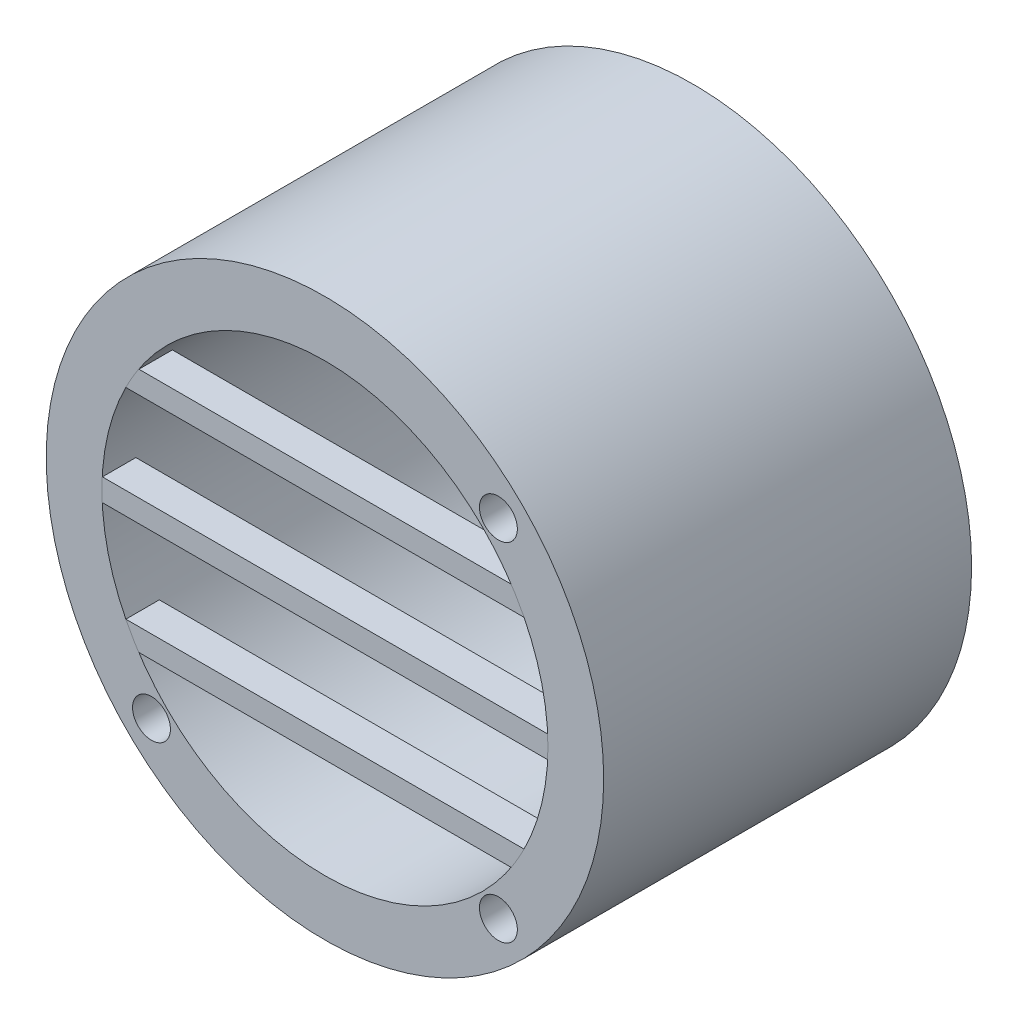
ISO-10303-21;
HEADER;
FILE_DESCRIPTION(('STEP AP214'),'2;1');
FILE_NAME('part.step','',(''),(''),'','','');
FILE_SCHEMA(('AUTOMOTIVE_DESIGN { 1 0 10303 214 1 1 1 1 }'));
ENDSEC;
DATA;
#1=APPLICATION_CONTEXT('core data for automotive mechanical design processes');
#2=APPLICATION_PROTOCOL_DEFINITION('international standard','automotive_design',2000,#1);
#3=PRODUCT_CONTEXT('',#1,'mechanical');
#4=PRODUCT('Part','Part','',(#3));
#5=PRODUCT_RELATED_PRODUCT_CATEGORY('part','',(#4));
#6=PRODUCT_DEFINITION_FORMATION('','',#4);
#7=PRODUCT_DEFINITION_CONTEXT('part definition',#1,'design');
#8=PRODUCT_DEFINITION('design','',#6,#7);
#9=PRODUCT_DEFINITION_SHAPE('','',#8);
#10=(LENGTH_UNIT() NAMED_UNIT(*) SI_UNIT(.MILLI.,.METRE.));
#11=(NAMED_UNIT(*) PLANE_ANGLE_UNIT() SI_UNIT($,.RADIAN.));
#12=(NAMED_UNIT(*) SI_UNIT($,.STERADIAN.) SOLID_ANGLE_UNIT());
#13=UNCERTAINTY_MEASURE_WITH_UNIT(LENGTH_MEASURE(1.E-05),#10,'distance_accuracy_value','');
#14=(GEOMETRIC_REPRESENTATION_CONTEXT(3) GLOBAL_UNCERTAINTY_ASSIGNED_CONTEXT((#13)) GLOBAL_UNIT_ASSIGNED_CONTEXT((#10,
#11,#12)) REPRESENTATION_CONTEXT('',''));
#15=CARTESIAN_POINT('',(0.,0.,0.));
#16=DIRECTION('',(0.,0.,1.));
#17=DIRECTION('',(1.,0.,0.));
#18=AXIS2_PLACEMENT_3D('',#15,#16,#17);
#19=CARTESIAN_POINT('',(0.,-8.99999999999859,30.));
#20=DIRECTION('',(0.,-1.,0.));
#21=DIRECTION('',(0.,0.,-1.));
#22=AXIS2_PLACEMENT_3D('',#19,#20,#21);
#23=PLANE('',#22);
#24=DIRECTION('',(1.,0.,0.));
#25=VECTOR('',#24,1.);
#26=CARTESIAN_POINT('',(0.,-8.99999999999859,33.));
#27=LINE('',#26,#25);
#28=CARTESIAN_POINT('',(-17.8605710994925,-8.99999999999859,33.));
#29=VERTEX_POINT('',#28);
#30=CARTESIAN_POINT('',(17.8605710994925,-8.99999999999859,33.));
#31=VERTEX_POINT('',#30);
#32=EDGE_CURVE('E114',#29,#31,#27,.T.);
#33=ORIENTED_EDGE('',*,*,#32,.T.);
#34=DIRECTION('',(0.,0.,1.));
#35=VECTOR('',#34,1.);
#36=CARTESIAN_POINT('',(17.8605710994925,-8.99999999999859,30.));
#37=LINE('',#36,#35);
#38=CARTESIAN_POINT('',(17.8605710994925,-8.99999999999859,30.));
#39=VERTEX_POINT('',#38);
#40=EDGE_CURVE('E12',#39,#31,#37,.T.);
#41=ORIENTED_EDGE('',*,*,#40,.F.);
#42=DIRECTION('',(1.,0.,0.));
#43=VECTOR('',#42,1.);
#44=CARTESIAN_POINT('',(0.,-8.99999999999859,30.));
#45=LINE('',#44,#43);
#46=CARTESIAN_POINT('',(-17.8605710994925,-8.99999999999859,30.));
#47=VERTEX_POINT('',#46);
#48=EDGE_CURVE('E108',#47,#39,#45,.T.);
#49=ORIENTED_EDGE('',*,*,#48,.F.);
#50=DIRECTION('',(0.,0.,1.));
#51=VECTOR('',#50,1.);
#52=CARTESIAN_POINT('',(-17.8605710994925,-8.99999999999859,30.));
#53=LINE('',#52,#51);
#54=EDGE_CURVE('E54',#47,#29,#53,.T.);
#55=ORIENTED_EDGE('',*,*,#54,.T.);
#56=EDGE_LOOP('',(#33,#41,#49,#55));
#57=FACE_BOUND('',#56,.T.);
#58=ADVANCED_FACE('F51',(#57),#23,.F.);
#59=CARTESIAN_POINT('',(0.,0.,30.));
#60=DIRECTION('',(0.,0.,1.));
#61=DIRECTION('',(1.,0.,0.));
#62=AXIS2_PLACEMENT_3D('',#59,#60,#61);
#63=CYLINDRICAL_SURFACE('',#62,20.);
#64=CARTESIAN_POINT('',(0.,0.,33.));
#65=DIRECTION('',(0.,0.,1.));
#66=DIRECTION('',(1.,0.,0.));
#67=AXIS2_PLACEMENT_3D('',#64,#65,#66);
#68=CIRCLE('',#67,20.);
#69=CARTESIAN_POINT('',(16.703293088491,-10.9999999999986,33.));
#70=VERTEX_POINT('',#69);
#71=EDGE_CURVE('E90',#31,#70,#68,.F.);
#72=ORIENTED_EDGE('',*,*,#71,.T.);
#73=DIRECTION('',(0.,0.,1.));
#74=VECTOR('',#73,1.);
#75=CARTESIAN_POINT('',(16.703293088491,-10.9999999999986,30.));
#76=LINE('',#75,#74);
#77=CARTESIAN_POINT('',(16.703293088491,-10.9999999999986,30.));
#78=VERTEX_POINT('',#77);
#79=EDGE_CURVE('E60',#78,#70,#76,.T.);
#80=ORIENTED_EDGE('',*,*,#79,.F.);
#81=CARTESIAN_POINT('',(0.,0.,30.));
#82=DIRECTION('',(0.,0.,1.));
#83=DIRECTION('',(1.,0.,0.));
#84=AXIS2_PLACEMENT_3D('',#81,#82,#83);
#85=CIRCLE('',#84,20.);
#86=EDGE_CURVE('E68',#39,#78,#85,.F.);
#87=ORIENTED_EDGE('',*,*,#86,.F.);
#88=ORIENTED_EDGE('',*,*,#40,.T.);
#89=EDGE_LOOP('',(#72,#80,#87,#88));
#90=FACE_BOUND('',#89,.T.);
#91=ADVANCED_FACE('F122',(#90),#63,.T.);
#92=CARTESIAN_POINT('',(0.,-10.9999999999986,30.));
#93=DIRECTION('',(0.,-1.,0.));
#94=DIRECTION('',(0.,0.,-1.));
#95=AXIS2_PLACEMENT_3D('',#92,#93,#94);
#96=PLANE('',#95);
#97=DIRECTION('',(1.,0.,0.));
#98=VECTOR('',#97,1.);
#99=CARTESIAN_POINT('',(0.,-10.9999999999986,33.));
#100=LINE('',#99,#98);
#101=CARTESIAN_POINT('',(-16.703293088491,-10.9999999999986,33.));
#102=VERTEX_POINT('',#101);
#103=EDGE_CURVE('E102',#102,#70,#100,.T.);
#104=ORIENTED_EDGE('',*,*,#103,.F.);
#105=DIRECTION('',(0.,0.,1.));
#106=VECTOR('',#105,1.);
#107=CARTESIAN_POINT('',(-16.703293088491,-10.9999999999986,30.));
#108=LINE('',#107,#106);
#109=CARTESIAN_POINT('',(-16.703293088491,-10.9999999999986,30.));
#110=VERTEX_POINT('',#109);
#111=EDGE_CURVE('E99',#110,#102,#108,.T.);
#112=ORIENTED_EDGE('',*,*,#111,.F.);
#113=DIRECTION('',(1.,0.,0.));
#114=VECTOR('',#113,1.);
#115=CARTESIAN_POINT('',(0.,-10.9999999999986,30.));
#116=LINE('',#115,#114);
#117=EDGE_CURVE('E101',#110,#78,#116,.T.);
#118=ORIENTED_EDGE('',*,*,#117,.T.);
#119=ORIENTED_EDGE('',*,*,#79,.T.);
#120=EDGE_LOOP('',(#104,#112,#118,#119));
#121=FACE_BOUND('',#120,.T.);
#122=ADVANCED_FACE('F100',(#121),#96,.T.);
#123=EDGE_CURVE('E117',#102,#29,#68,.F.);
#124=ORIENTED_EDGE('',*,*,#123,.T.);
#125=ORIENTED_EDGE('',*,*,#54,.F.);
#126=EDGE_CURVE('E96',#110,#47,#85,.F.);
#127=ORIENTED_EDGE('',*,*,#126,.F.);
#128=ORIENTED_EDGE('',*,*,#111,.T.);
#129=EDGE_LOOP('',(#124,#125,#127,#128));
#130=FACE_BOUND('',#129,.T.);
#131=ADVANCED_FACE('F105',(#130),#63,.T.);
#132=CARTESIAN_POINT('',(0.,0.,30.));
#133=DIRECTION('',(0.,0.,1.));
#134=DIRECTION('',(1.,0.,0.));
#135=AXIS2_PLACEMENT_3D('',#132,#133,#134);
#136=PLANE('',#135);
#137=ORIENTED_EDGE('',*,*,#48,.T.);
#138=ORIENTED_EDGE('',*,*,#86,.T.);
#139=ORIENTED_EDGE('',*,*,#117,.F.);
#140=ORIENTED_EDGE('',*,*,#126,.T.);
#141=EDGE_LOOP('',(#137,#138,#139,#140));
#142=FACE_BOUND('',#141,.T.);
#143=ADVANCED_FACE('F110',(#142),#136,.F.);
#144=CARTESIAN_POINT('',(0.,0.,33.));
#145=DIRECTION('',(0.,0.,1.));
#146=DIRECTION('',(1.,0.,0.));
#147=AXIS2_PLACEMENT_3D('',#144,#145,#146);
#148=PLANE('',#147);
#149=ORIENTED_EDGE('',*,*,#32,.F.);
#150=ORIENTED_EDGE('',*,*,#123,.F.);
#151=ORIENTED_EDGE('',*,*,#103,.T.);
#152=ORIENTED_EDGE('',*,*,#71,.F.);
#153=EDGE_LOOP('',(#149,#150,#151,#152));
#154=FACE_BOUND('',#153,.T.);
#155=ADVANCED_FACE('F134',(#154),#148,.T.);
#156=CLOSED_SHELL('',(#58,#91,#122,#131,#143,#155));
#157=MANIFOLD_SOLID_BREP('B2',#156);
#158=CARTESIAN_POINT('',(0.,1.00000000000141,30.));
#159=DIRECTION('',(0.,-1.,0.));
#160=DIRECTION('',(0.,0.,-1.));
#161=AXIS2_PLACEMENT_3D('',#158,#159,#160);
#162=PLANE('',#161);
#163=DIRECTION('',(1.,0.,0.));
#164=VECTOR('',#163,1.);
#165=CARTESIAN_POINT('',(0.,1.00000000000141,33.));
#166=LINE('',#165,#164);
#167=CARTESIAN_POINT('',(-19.9749843554381,1.00000000000141,33.));
#168=VERTEX_POINT('',#167);
#169=CARTESIAN_POINT('',(19.9749843554381,1.00000000000141,33.));
#170=VERTEX_POINT('',#169);
#171=EDGE_CURVE('E256',#168,#170,#166,.T.);
#172=ORIENTED_EDGE('',*,*,#171,.T.);
#173=DIRECTION('',(0.,0.,1.));
#174=VECTOR('',#173,1.);
#175=CARTESIAN_POINT('',(19.9749843554381,1.00000000000141,30.));
#176=LINE('',#175,#174);
#177=CARTESIAN_POINT('',(19.9749843554381,1.00000000000141,30.));
#178=VERTEX_POINT('',#177);
#179=EDGE_CURVE('E49',#178,#170,#176,.T.);
#180=ORIENTED_EDGE('',*,*,#179,.F.);
#181=DIRECTION('',(1.,0.,0.));
#182=VECTOR('',#181,1.);
#183=CARTESIAN_POINT('',(0.,1.00000000000141,30.));
#184=LINE('',#183,#182);
#185=CARTESIAN_POINT('',(-19.9749843554381,1.00000000000141,30.));
#186=VERTEX_POINT('',#185);
#187=EDGE_CURVE('E250',#186,#178,#184,.T.);
#188=ORIENTED_EDGE('',*,*,#187,.F.);
#189=DIRECTION('',(0.,0.,1.));
#190=VECTOR('',#189,1.);
#191=CARTESIAN_POINT('',(-19.9749843554381,1.00000000000141,30.));
#192=LINE('',#191,#190);
#193=EDGE_CURVE('E196',#186,#168,#192,.T.);
#194=ORIENTED_EDGE('',*,*,#193,.T.);
#195=EDGE_LOOP('',(#172,#180,#188,#194));
#196=FACE_BOUND('',#195,.T.);
#197=ADVANCED_FACE('F193',(#196),#162,.F.);
#198=CARTESIAN_POINT('',(0.,0.,30.));
#199=DIRECTION('',(0.,0.,1.));
#200=DIRECTION('',(1.,0.,0.));
#201=AXIS2_PLACEMENT_3D('',#198,#199,#200);
#202=CYLINDRICAL_SURFACE('',#201,20.);
#203=CARTESIAN_POINT('',(0.,0.,33.));
#204=DIRECTION('',(0.,0.,1.));
#205=DIRECTION('',(1.,0.,0.));
#206=AXIS2_PLACEMENT_3D('',#203,#204,#205);
#207=CIRCLE('',#206,20.);
#208=CARTESIAN_POINT('',(19.9749843554382,-0.999999999998591,33.));
#209=VERTEX_POINT('',#208);
#210=EDGE_CURVE('E232',#170,#209,#207,.F.);
#211=ORIENTED_EDGE('',*,*,#210,.T.);
#212=DIRECTION('',(0.,0.,1.));
#213=VECTOR('',#212,1.);
#214=CARTESIAN_POINT('',(19.9749843554382,-0.999999999998591,30.));
#215=LINE('',#214,#213);
#216=CARTESIAN_POINT('',(19.9749843554382,-0.999999999998591,30.));
#217=VERTEX_POINT('',#216);
#218=EDGE_CURVE('E202',#217,#209,#215,.T.);
#219=ORIENTED_EDGE('',*,*,#218,.F.);
#220=CARTESIAN_POINT('',(0.,0.,30.));
#221=DIRECTION('',(0.,0.,1.));
#222=DIRECTION('',(1.,0.,0.));
#223=AXIS2_PLACEMENT_3D('',#220,#221,#222);
#224=CIRCLE('',#223,20.);
#225=EDGE_CURVE('E210',#178,#217,#224,.F.);
#226=ORIENTED_EDGE('',*,*,#225,.F.);
#227=ORIENTED_EDGE('',*,*,#179,.T.);
#228=EDGE_LOOP('',(#211,#219,#226,#227));
#229=FACE_BOUND('',#228,.T.);
#230=ADVANCED_FACE('F264',(#229),#202,.T.);
#231=CARTESIAN_POINT('',(0.,-0.999999999998591,30.));
#232=DIRECTION('',(0.,-1.,0.));
#233=DIRECTION('',(0.,0.,-1.));
#234=AXIS2_PLACEMENT_3D('',#231,#232,#233);
#235=PLANE('',#234);
#236=DIRECTION('',(1.,0.,0.));
#237=VECTOR('',#236,1.);
#238=CARTESIAN_POINT('',(0.,-0.999999999998591,33.));
#239=LINE('',#238,#237);
#240=CARTESIAN_POINT('',(-19.9749843554382,-0.999999999998591,33.));
#241=VERTEX_POINT('',#240);
#242=EDGE_CURVE('E244',#241,#209,#239,.T.);
#243=ORIENTED_EDGE('',*,*,#242,.F.);
#244=DIRECTION('',(0.,0.,1.));
#245=VECTOR('',#244,1.);
#246=CARTESIAN_POINT('',(-19.9749843554382,-0.999999999998591,30.));
#247=LINE('',#246,#245);
#248=CARTESIAN_POINT('',(-19.9749843554382,-0.999999999998591,30.));
#249=VERTEX_POINT('',#248);
#250=EDGE_CURVE('E241',#249,#241,#247,.T.);
#251=ORIENTED_EDGE('',*,*,#250,.F.);
#252=DIRECTION('',(1.,0.,0.));
#253=VECTOR('',#252,1.);
#254=CARTESIAN_POINT('',(0.,-0.999999999998591,30.));
#255=LINE('',#254,#253);
#256=EDGE_CURVE('E243',#249,#217,#255,.T.);
#257=ORIENTED_EDGE('',*,*,#256,.T.);
#258=ORIENTED_EDGE('',*,*,#218,.T.);
#259=EDGE_LOOP('',(#243,#251,#257,#258));
#260=FACE_BOUND('',#259,.T.);
#261=ADVANCED_FACE('F242',(#260),#235,.T.);
#262=EDGE_CURVE('E259',#241,#168,#207,.F.);
#263=ORIENTED_EDGE('',*,*,#262,.T.);
#264=ORIENTED_EDGE('',*,*,#193,.F.);
#265=EDGE_CURVE('E238',#249,#186,#224,.F.);
#266=ORIENTED_EDGE('',*,*,#265,.F.);
#267=ORIENTED_EDGE('',*,*,#250,.T.);
#268=EDGE_LOOP('',(#263,#264,#266,#267));
#269=FACE_BOUND('',#268,.T.);
#270=ADVANCED_FACE('F247',(#269),#202,.T.);
#271=CARTESIAN_POINT('',(0.,0.,30.));
#272=DIRECTION('',(0.,0.,1.));
#273=DIRECTION('',(1.,0.,0.));
#274=AXIS2_PLACEMENT_3D('',#271,#272,#273);
#275=PLANE('',#274);
#276=ORIENTED_EDGE('',*,*,#187,.T.);
#277=ORIENTED_EDGE('',*,*,#225,.T.);
#278=ORIENTED_EDGE('',*,*,#256,.F.);
#279=ORIENTED_EDGE('',*,*,#265,.T.);
#280=EDGE_LOOP('',(#276,#277,#278,#279));
#281=FACE_BOUND('',#280,.T.);
#282=ADVANCED_FACE('F252',(#281),#275,.F.);
#283=CARTESIAN_POINT('',(0.,0.,33.));
#284=DIRECTION('',(0.,0.,1.));
#285=DIRECTION('',(1.,0.,0.));
#286=AXIS2_PLACEMENT_3D('',#283,#284,#285);
#287=PLANE('',#286);
#288=ORIENTED_EDGE('',*,*,#171,.F.);
#289=ORIENTED_EDGE('',*,*,#262,.F.);
#290=ORIENTED_EDGE('',*,*,#242,.T.);
#291=ORIENTED_EDGE('',*,*,#210,.F.);
#292=EDGE_LOOP('',(#288,#289,#290,#291));
#293=FACE_BOUND('',#292,.T.);
#294=ADVANCED_FACE('F276',(#293),#287,.T.);
#295=CLOSED_SHELL('',(#197,#230,#261,#270,#282,#294));
#296=MANIFOLD_SOLID_BREP('B6',#295);
#297=CARTESIAN_POINT('',(0.,0.,30.));
#298=DIRECTION('',(0.,0.,1.));
#299=DIRECTION('',(1.,0.,0.));
#300=AXIS2_PLACEMENT_3D('',#297,#298,#299);
#301=CYLINDRICAL_SURFACE('',#300,20.);
#302=CARTESIAN_POINT('',(0.,0.,33.));
#303=DIRECTION('',(0.,0.,1.));
#304=DIRECTION('',(1.,0.,0.));
#305=AXIS2_PLACEMENT_3D('',#302,#303,#304);
#306=CIRCLE('',#305,20.);
#307=CARTESIAN_POINT('',(-17.860571099491,9.00000000000141,33.));
#308=VERTEX_POINT('',#307);
#309=CARTESIAN_POINT('',(-16.7032930884891,11.0000000000014,33.));
#310=VERTEX_POINT('',#309);
#311=EDGE_CURVE('E389',#308,#310,#306,.F.);
#312=ORIENTED_EDGE('',*,*,#311,.T.);
#313=DIRECTION('',(0.,0.,1.));
#314=VECTOR('',#313,1.);
#315=CARTESIAN_POINT('',(-16.7032930884891,11.0000000000014,30.));
#316=LINE('',#315,#314);
#317=CARTESIAN_POINT('',(-16.7032930884891,11.0000000000014,30.));
#318=VERTEX_POINT('',#317);
#319=EDGE_CURVE('E191',#318,#310,#316,.T.);
#320=ORIENTED_EDGE('',*,*,#319,.F.);
#321=CARTESIAN_POINT('',(0.,0.,30.));
#322=DIRECTION('',(0.,0.,1.));
#323=DIRECTION('',(1.,0.,0.));
#324=AXIS2_PLACEMENT_3D('',#321,#322,#323);
#325=CIRCLE('',#324,20.);
#326=CARTESIAN_POINT('',(-17.860571099491,9.00000000000141,30.));
#327=VERTEX_POINT('',#326);
#328=EDGE_CURVE('E380',#327,#318,#325,.F.);
#329=ORIENTED_EDGE('',*,*,#328,.F.);
#330=DIRECTION('',(0.,0.,1.));
#331=VECTOR('',#330,1.);
#332=CARTESIAN_POINT('',(-17.860571099491,9.00000000000141,30.));
#333=LINE('',#332,#331);
#334=EDGE_CURVE('E330',#327,#308,#333,.T.);
#335=ORIENTED_EDGE('',*,*,#334,.T.);
#336=EDGE_LOOP('',(#312,#320,#329,#335));
#337=FACE_BOUND('',#336,.T.);
#338=ADVANCED_FACE('F326',(#337),#301,.T.);
#339=CARTESIAN_POINT('',(0.,11.0000000000014,30.));
#340=DIRECTION('',(0.,-1.,0.));
#341=DIRECTION('',(0.,0.,-1.));
#342=AXIS2_PLACEMENT_3D('',#339,#340,#341);
#343=PLANE('',#342);
#344=DIRECTION('',(1.,0.,0.));
#345=VECTOR('',#344,1.);
#346=CARTESIAN_POINT('',(0.,11.0000000000014,33.));
#347=LINE('',#346,#345);
#348=CARTESIAN_POINT('',(16.7032930884891,11.0000000000014,33.));
#349=VERTEX_POINT('',#348);
#350=EDGE_CURVE('E358',#310,#349,#347,.T.);
#351=ORIENTED_EDGE('',*,*,#350,.T.);
#352=DIRECTION('',(0.,0.,1.));
#353=VECTOR('',#352,1.);
#354=CARTESIAN_POINT('',(16.7032930884891,11.0000000000014,30.));
#355=LINE('',#354,#353);
#356=CARTESIAN_POINT('',(16.7032930884891,11.0000000000014,30.));
#357=VERTEX_POINT('',#356);
#358=EDGE_CURVE('E336',#357,#349,#355,.T.);
#359=ORIENTED_EDGE('',*,*,#358,.F.);
#360=DIRECTION('',(1.,0.,0.));
#361=VECTOR('',#360,1.);
#362=CARTESIAN_POINT('',(0.,11.0000000000014,30.));
#363=LINE('',#362,#361);
#364=EDGE_CURVE('E344',#318,#357,#363,.T.);
#365=ORIENTED_EDGE('',*,*,#364,.F.);
#366=ORIENTED_EDGE('',*,*,#319,.T.);
#367=EDGE_LOOP('',(#351,#359,#365,#366));
#368=FACE_BOUND('',#367,.T.);
#369=ADVANCED_FACE('F398',(#368),#343,.F.);
#370=CARTESIAN_POINT('',(17.860571099491,9.00000000000141,33.));
#371=VERTEX_POINT('',#370);
#372=EDGE_CURVE('E384',#349,#371,#306,.F.);
#373=ORIENTED_EDGE('',*,*,#372,.T.);
#374=DIRECTION('',(0.,0.,1.));
#375=VECTOR('',#374,1.);
#376=CARTESIAN_POINT('',(17.860571099491,9.00000000000141,30.));
#377=LINE('',#376,#375);
#378=CARTESIAN_POINT('',(17.860571099491,9.00000000000141,30.));
#379=VERTEX_POINT('',#378);
#380=EDGE_CURVE('E382',#379,#371,#377,.T.);
#381=ORIENTED_EDGE('',*,*,#380,.F.);
#382=EDGE_CURVE('E374',#357,#379,#325,.F.);
#383=ORIENTED_EDGE('',*,*,#382,.F.);
#384=ORIENTED_EDGE('',*,*,#358,.T.);
#385=EDGE_LOOP('',(#373,#381,#383,#384));
#386=FACE_BOUND('',#385,.T.);
#387=ADVANCED_FACE('F383',(#386),#301,.T.);
#388=CARTESIAN_POINT('',(0.,9.00000000000141,30.));
#389=DIRECTION('',(0.,-1.,0.));
#390=DIRECTION('',(1.,0.,0.));
#391=AXIS2_PLACEMENT_3D('',#388,#389,#390);
#392=PLANE('',#391);
#393=DIRECTION('',(1.,0.,0.));
#394=VECTOR('',#393,1.);
#395=CARTESIAN_POINT('',(0.,9.00000000000141,33.));
#396=LINE('',#395,#394);
#397=EDGE_CURVE('E392',#308,#371,#396,.T.);
#398=ORIENTED_EDGE('',*,*,#397,.F.);
#399=ORIENTED_EDGE('',*,*,#334,.F.);
#400=DIRECTION('',(1.,0.,0.));
#401=VECTOR('',#400,1.);
#402=CARTESIAN_POINT('',(0.,9.00000000000141,30.));
#403=LINE('',#402,#401);
#404=EDGE_CURVE('E377',#327,#379,#403,.T.);
#405=ORIENTED_EDGE('',*,*,#404,.T.);
#406=ORIENTED_EDGE('',*,*,#380,.T.);
#407=EDGE_LOOP('',(#398,#399,#405,#406));
#408=FACE_BOUND('',#407,.T.);
#409=ADVANCED_FACE('F328',(#408),#392,.T.);
#410=CARTESIAN_POINT('',(0.,0.,30.));
#411=DIRECTION('',(0.,0.,1.));
#412=DIRECTION('',(1.,0.,0.));
#413=AXIS2_PLACEMENT_3D('',#410,#411,#412);
#414=PLANE('',#413);
#415=ORIENTED_EDGE('',*,*,#328,.T.);
#416=ORIENTED_EDGE('',*,*,#364,.T.);
#417=ORIENTED_EDGE('',*,*,#382,.T.);
#418=ORIENTED_EDGE('',*,*,#404,.F.);
#419=EDGE_LOOP('',(#415,#416,#417,#418));
#420=FACE_BOUND('',#419,.T.);
#421=ADVANCED_FACE('F376',(#420),#414,.F.);
#422=CARTESIAN_POINT('',(0.,0.,33.));
#423=DIRECTION('',(0.,0.,1.));
#424=DIRECTION('',(1.,0.,0.));
#425=AXIS2_PLACEMENT_3D('',#422,#423,#424);
#426=PLANE('',#425);
#427=ORIENTED_EDGE('',*,*,#311,.F.);
#428=ORIENTED_EDGE('',*,*,#397,.T.);
#429=ORIENTED_EDGE('',*,*,#372,.F.);
#430=ORIENTED_EDGE('',*,*,#350,.F.);
#431=EDGE_LOOP('',(#427,#428,#429,#430));
#432=FACE_BOUND('',#431,.T.);
#433=ADVANCED_FACE('F395',(#432),#426,.T.);
#434=CLOSED_SHELL('',(#338,#369,#387,#409,#421,#433));
#435=MANIFOLD_SOLID_BREP('B43',#434);
#436=CARTESIAN_POINT('',(0.,0.,33.));
#437=DIRECTION('',(0.,0.,1.));
#438=DIRECTION('',(1.,0.,0.));
#439=AXIS2_PLACEMENT_3D('',#436,#437,#438);
#440=PLANE('',#439);
#441=CARTESIAN_POINT('',(15.5563491861041,15.556349186104,33.));
#442=DIRECTION('',(0.,0.,-1.));
#443=DIRECTION('',(-1.,0.,0.));
#444=AXIS2_PLACEMENT_3D('',#441,#442,#443);
#445=CIRCLE('',#444,1.69999999999999);
#446=CARTESIAN_POINT('',(13.8563491861041,15.556349186104,33.));
#447=VERTEX_POINT('',#446);
#448=EDGE_CURVE('E490',#447,#447,#445,.T.);
#449=ORIENTED_EDGE('',*,*,#448,.T.);
#450=EDGE_LOOP('',(#449));
#451=FACE_BOUND('',#450,.T.);
#452=CARTESIAN_POINT('',(15.556349186104,-15.5563491861041,33.));
#453=DIRECTION('',(0.,0.,-1.));
#454=DIRECTION('',(-1.,0.,0.));
#455=AXIS2_PLACEMENT_3D('',#452,#453,#454);
#456=CIRCLE('',#455,1.69999999999999);
#457=CARTESIAN_POINT('',(13.856349186104,-15.5563491861041,33.));
#458=VERTEX_POINT('',#457);
#459=EDGE_CURVE('E484',#458,#458,#456,.T.);
#460=ORIENTED_EDGE('',*,*,#459,.T.);
#461=EDGE_LOOP('',(#460));
#462=FACE_BOUND('',#461,.T.);
#463=CARTESIAN_POINT('',(-15.5563491861041,-15.556349186104,33.));
#464=DIRECTION('',(0.,0.,-1.));
#465=DIRECTION('',(-1.,0.,0.));
#466=AXIS2_PLACEMENT_3D('',#463,#464,#465);
#467=CIRCLE('',#466,1.69999999999999);
#468=CARTESIAN_POINT('',(-17.2563491861041,-15.556349186104,33.));
#469=VERTEX_POINT('',#468);
#470=EDGE_CURVE('E481',#469,#469,#467,.T.);
#471=ORIENTED_EDGE('',*,*,#470,.T.);
#472=EDGE_LOOP('',(#471));
#473=FACE_BOUND('',#472,.T.);
#474=CARTESIAN_POINT('',(0.,0.,33.));
#475=DIRECTION('',(0.,0.,1.));
#476=DIRECTION('',(1.,0.,0.));
#477=AXIS2_PLACEMENT_3D('',#474,#475,#476);
#478=CIRCLE('',#477,25.);
#479=CARTESIAN_POINT('',(25.,0.,33.));
#480=VERTEX_POINT('',#479);
#481=EDGE_CURVE('E325',#480,#480,#478,.T.);
#482=ORIENTED_EDGE('',*,*,#481,.T.);
#483=EDGE_LOOP('',(#482));
#484=FACE_BOUND('',#483,.T.);
#485=CARTESIAN_POINT('',(0.,0.,33.));
#486=DIRECTION('',(0.,0.,1.));
#487=DIRECTION('',(1.,0.,0.));
#488=AXIS2_PLACEMENT_3D('',#485,#486,#487);
#489=CIRCLE('',#488,20.);
#490=CARTESIAN_POINT('',(20.,0.,33.));
#491=VERTEX_POINT('',#490);
#492=EDGE_CURVE('E471',#491,#491,#489,.T.);
#493=ORIENTED_EDGE('',*,*,#492,.F.);
#494=EDGE_LOOP('',(#493));
#495=FACE_BOUND('',#494,.T.);
#496=ADVANCED_FACE('F458',(#451,#462,#473,#484,#495),#440,.T.);
#497=CARTESIAN_POINT('',(0.,0.,0.));
#498=DIRECTION('',(0.,0.,1.));
#499=DIRECTION('',(1.,0.,0.));
#500=AXIS2_PLACEMENT_3D('',#497,#498,#499);
#501=PLANE('',#500);
#502=CARTESIAN_POINT('',(15.5563491861041,15.556349186104,0.));
#503=DIRECTION('',(0.,0.,1.));
#504=DIRECTION('',(1.,0.,0.));
#505=AXIS2_PLACEMENT_3D('',#502,#503,#504);
#506=CIRCLE('',#505,1.69999999999999);
#507=CARTESIAN_POINT('',(17.2563491861041,15.556349186104,0.));
#508=VERTEX_POINT('',#507);
#509=EDGE_CURVE('E487',#508,#508,#506,.T.);
#510=ORIENTED_EDGE('',*,*,#509,.T.);
#511=EDGE_LOOP('',(#510));
#512=FACE_BOUND('',#511,.T.);
#513=CARTESIAN_POINT('',(15.556349186104,-15.5563491861041,0.));
#514=DIRECTION('',(0.,0.,1.));
#515=DIRECTION('',(1.,0.,0.));
#516=AXIS2_PLACEMENT_3D('',#513,#514,#515);
#517=CIRCLE('',#516,1.69999999999999);
#518=CARTESIAN_POINT('',(17.256349186104,-15.5563491861041,0.));
#519=VERTEX_POINT('',#518);
#520=EDGE_CURVE('E462',#519,#519,#517,.T.);
#521=ORIENTED_EDGE('',*,*,#520,.T.);
#522=EDGE_LOOP('',(#521));
#523=FACE_BOUND('',#522,.T.);
#524=CARTESIAN_POINT('',(-15.5563491861041,-15.556349186104,0.));
#525=DIRECTION('',(0.,0.,1.));
#526=DIRECTION('',(1.,0.,0.));
#527=AXIS2_PLACEMENT_3D('',#524,#525,#526);
#528=CIRCLE('',#527,1.69999999999999);
#529=CARTESIAN_POINT('',(-13.8563491861041,-15.556349186104,0.));
#530=VERTEX_POINT('',#529);
#531=EDGE_CURVE('E476',#530,#530,#528,.T.);
#532=ORIENTED_EDGE('',*,*,#531,.T.);
#533=EDGE_LOOP('',(#532));
#534=FACE_BOUND('',#533,.T.);
#535=CARTESIAN_POINT('',(0.,0.,0.));
#536=DIRECTION('',(0.,0.,1.));
#537=DIRECTION('',(1.,0.,0.));
#538=AXIS2_PLACEMENT_3D('',#535,#536,#537);
#539=CIRCLE('',#538,25.);
#540=CARTESIAN_POINT('',(25.,0.,0.));
#541=VERTEX_POINT('',#540);
#542=EDGE_CURVE('E466',#541,#541,#539,.T.);
#543=ORIENTED_EDGE('',*,*,#542,.F.);
#544=EDGE_LOOP('',(#543));
#545=FACE_BOUND('',#544,.T.);
#546=CARTESIAN_POINT('',(0.,0.,0.));
#547=DIRECTION('',(0.,0.,1.));
#548=DIRECTION('',(1.,0.,0.));
#549=AXIS2_PLACEMENT_3D('',#546,#547,#548);
#550=CIRCLE('',#549,20.);
#551=CARTESIAN_POINT('',(20.,0.,0.));
#552=VERTEX_POINT('',#551);
#553=EDGE_CURVE('E473',#552,#552,#550,.T.);
#554=ORIENTED_EDGE('',*,*,#553,.T.);
#555=EDGE_LOOP('',(#554));
#556=FACE_BOUND('',#555,.T.);
#557=ADVANCED_FACE('F503',(#512,#523,#534,#545,#556),#501,.F.);
#558=CARTESIAN_POINT('',(0.,0.,33.));
#559=DIRECTION('',(0.,0.,-1.));
#560=DIRECTION('',(-1.,0.,0.));
#561=AXIS2_PLACEMENT_3D('',#558,#559,#560);
#562=CYLINDRICAL_SURFACE('',#561,25.);
#563=ORIENTED_EDGE('',*,*,#481,.F.);
#564=EDGE_LOOP('',(#563));
#565=FACE_BOUND('',#564,.T.);
#566=ORIENTED_EDGE('',*,*,#542,.T.);
#567=EDGE_LOOP('',(#566));
#568=FACE_BOUND('',#567,.T.);
#569=ADVANCED_FACE('F460',(#565,#568),#562,.T.);
#570=CARTESIAN_POINT('',(0.,0.,33.));
#571=DIRECTION('',(0.,0.,-1.));
#572=DIRECTION('',(-1.,0.,0.));
#573=AXIS2_PLACEMENT_3D('',#570,#571,#572);
#574=CYLINDRICAL_SURFACE('',#573,20.);
#575=ORIENTED_EDGE('',*,*,#492,.T.);
#576=EDGE_LOOP('',(#575));
#577=FACE_BOUND('',#576,.T.);
#578=ORIENTED_EDGE('',*,*,#553,.F.);
#579=EDGE_LOOP('',(#578));
#580=FACE_BOUND('',#579,.T.);
#581=ADVANCED_FACE('F515',(#577,#580),#574,.F.);
#582=CARTESIAN_POINT('',(-15.5563491861041,-15.556349186104,-10.));
#583=DIRECTION('',(0.,0.,-1.));
#584=DIRECTION('',(-1.,0.,0.));
#585=AXIS2_PLACEMENT_3D('',#582,#583,#584);
#586=CYLINDRICAL_SURFACE('',#585,1.69999999999999);
#587=ORIENTED_EDGE('',*,*,#470,.F.);
#588=EDGE_LOOP('',(#587));
#589=FACE_BOUND('',#588,.T.);
#590=ORIENTED_EDGE('',*,*,#531,.F.);
#591=EDGE_LOOP('',(#590));
#592=FACE_BOUND('',#591,.T.);
#593=ADVANCED_FACE('F517',(#589,#592),#586,.F.);
#594=CARTESIAN_POINT('',(15.556349186104,-15.5563491861041,-10.));
#595=DIRECTION('',(0.,0.,-1.));
#596=DIRECTION('',(-1.,0.,0.));
#597=AXIS2_PLACEMENT_3D('',#594,#595,#596);
#598=CYLINDRICAL_SURFACE('',#597,1.69999999999999);
#599=ORIENTED_EDGE('',*,*,#459,.F.);
#600=EDGE_LOOP('',(#599));
#601=FACE_BOUND('',#600,.T.);
#602=ORIENTED_EDGE('',*,*,#520,.F.);
#603=EDGE_LOOP('',(#602));
#604=FACE_BOUND('',#603,.T.);
#605=ADVANCED_FACE('F499',(#601,#604),#598,.F.);
#606=CARTESIAN_POINT('',(15.5563491861041,15.556349186104,-10.));
#607=DIRECTION('',(0.,0.,-1.));
#608=DIRECTION('',(-1.,0.,0.));
#609=AXIS2_PLACEMENT_3D('',#606,#607,#608);
#610=CYLINDRICAL_SURFACE('',#609,1.69999999999999);
#611=ORIENTED_EDGE('',*,*,#448,.F.);
#612=EDGE_LOOP('',(#611));
#613=FACE_BOUND('',#612,.T.);
#614=ORIENTED_EDGE('',*,*,#509,.F.);
#615=EDGE_LOOP('',(#614));
#616=FACE_BOUND('',#615,.T.);
#617=ADVANCED_FACE('F496',(#613,#616),#610,.F.);
#618=CLOSED_SHELL('',(#496,#557,#569,#581,#593,#605,#617));
#619=MANIFOLD_SOLID_BREP('B185',#618);
#620=ADVANCED_BREP_SHAPE_REPRESENTATION('',(#18,#157,#296,#435,#619),#14);
#621=SHAPE_DEFINITION_REPRESENTATION(#9,#620);
ENDSEC;
END-ISO-10303-21;
